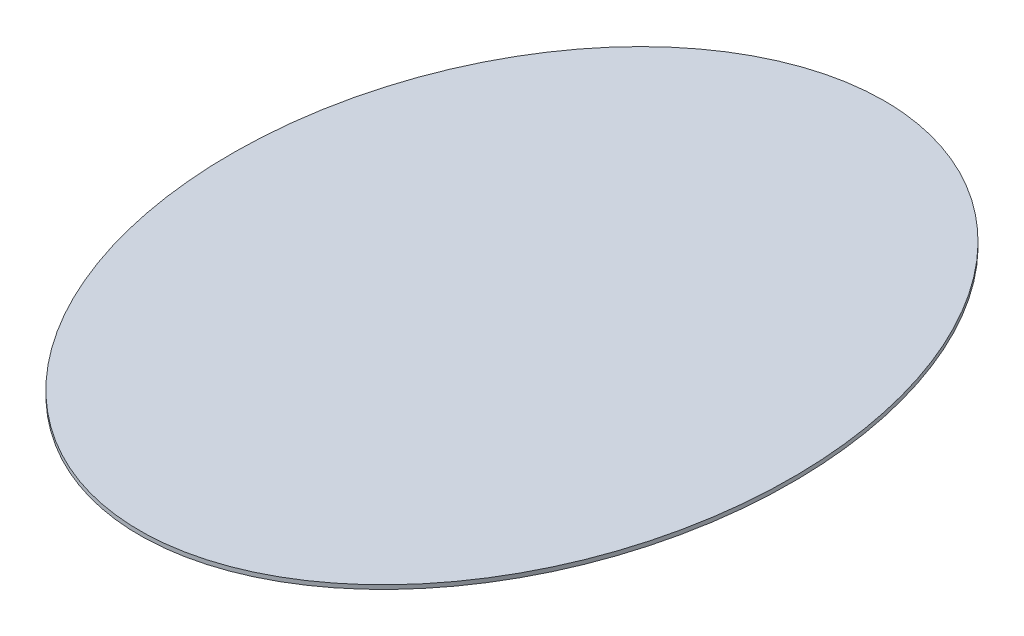
ISO-10303-21;
HEADER;
FILE_DESCRIPTION(('STEP AP214'),'2;1');
FILE_NAME('part.step','',(''),(''),'','','');
FILE_SCHEMA(('AUTOMOTIVE_DESIGN { 1 0 10303 214 1 1 1 1 }'));
ENDSEC;
DATA;
#1=APPLICATION_CONTEXT('core data for automotive mechanical design processes');
#2=APPLICATION_PROTOCOL_DEFINITION('international standard','automotive_design',2000,#1);
#3=PRODUCT_CONTEXT('',#1,'mechanical');
#4=PRODUCT('Part','Part','',(#3));
#5=PRODUCT_RELATED_PRODUCT_CATEGORY('part','',(#4));
#6=PRODUCT_DEFINITION_FORMATION('','',#4);
#7=PRODUCT_DEFINITION_CONTEXT('part definition',#1,'design');
#8=PRODUCT_DEFINITION('design','',#6,#7);
#9=PRODUCT_DEFINITION_SHAPE('','',#8);
#10=(LENGTH_UNIT() NAMED_UNIT(*) SI_UNIT(.MILLI.,.METRE.));
#11=(NAMED_UNIT(*) PLANE_ANGLE_UNIT() SI_UNIT($,.RADIAN.));
#12=(NAMED_UNIT(*) SI_UNIT($,.STERADIAN.) SOLID_ANGLE_UNIT());
#13=UNCERTAINTY_MEASURE_WITH_UNIT(LENGTH_MEASURE(1.E-05),#10,'distance_accuracy_value','');
#14=(GEOMETRIC_REPRESENTATION_CONTEXT(3) GLOBAL_UNCERTAINTY_ASSIGNED_CONTEXT((#13)) GLOBAL_UNIT_ASSIGNED_CONTEXT((#10,
#11,#12)) REPRESENTATION_CONTEXT('',''));
#15=CARTESIAN_POINT('',(0.,0.,0.));
#16=DIRECTION('',(0.,0.,1.));
#17=DIRECTION('',(1.,0.,0.));
#18=AXIS2_PLACEMENT_3D('',#15,#16,#17);
#19=CARTESIAN_POINT('',(0.,4.,0.));
#20=DIRECTION('',(0.,1.,0.));
#21=DIRECTION('',(0.,0.,-1.));
#22=AXIS2_PLACEMENT_3D('',#19,#20,#21);
#23=ELLIPSE('',#22,365.,275.);
#24=DIRECTION('',(0.,-1.,0.));
#25=VECTOR('',#24,1.);
#26=SURFACE_OF_LINEAR_EXTRUSION('',#23,#25);
#27=CARTESIAN_POINT('',(0.,4.,-365.));
#28=VERTEX_POINT('',#27);
#29=EDGE_CURVE('E10',#28,#28,#23,.T.);
#30=ORIENTED_EDGE('',*,*,#29,.F.);
#31=EDGE_LOOP('',(#30));
#32=FACE_BOUND('',#31,.T.);
#33=CARTESIAN_POINT('',(0.,0.,0.));
#34=DIRECTION('',(0.,1.,0.));
#35=DIRECTION('',(0.,0.,-1.));
#36=AXIS2_PLACEMENT_3D('',#33,#34,#35);
#37=ELLIPSE('',#36,365.,275.);
#38=CARTESIAN_POINT('',(0.,0.,-365.));
#39=VERTEX_POINT('',#38);
#40=EDGE_CURVE('E35',#39,#39,#37,.T.);
#41=ORIENTED_EDGE('',*,*,#40,.T.);
#42=EDGE_LOOP('',(#41));
#43=FACE_BOUND('',#42,.T.);
#44=ADVANCED_FACE('F31',(#32,#43),#26,.F.);
#45=CARTESIAN_POINT('',(0.,4.,0.));
#46=DIRECTION('',(0.,1.,0.));
#47=DIRECTION('',(0.,0.,1.));
#48=AXIS2_PLACEMENT_3D('',#45,#46,#47);
#49=PLANE('',#48);
#50=ORIENTED_EDGE('',*,*,#29,.T.);
#51=EDGE_LOOP('',(#50));
#52=FACE_BOUND('',#51,.T.);
#53=ADVANCED_FACE('F47',(#52),#49,.T.);
#54=CARTESIAN_POINT('',(0.,0.,0.));
#55=DIRECTION('',(0.,1.,0.));
#56=DIRECTION('',(0.,0.,1.));
#57=AXIS2_PLACEMENT_3D('',#54,#55,#56);
#58=PLANE('',#57);
#59=ORIENTED_EDGE('',*,*,#40,.F.);
#60=EDGE_LOOP('',(#59));
#61=FACE_BOUND('',#60,.T.);
#62=ADVANCED_FACE('F45',(#61),#58,.F.);
#63=CLOSED_SHELL('',(#44,#53,#62));
#64=MANIFOLD_SOLID_BREP('B2',#63);
#65=ADVANCED_BREP_SHAPE_REPRESENTATION('',(#18,#64),#14);
#66=SHAPE_DEFINITION_REPRESENTATION(#9,#65);
ENDSEC;
END-ISO-10303-21;
